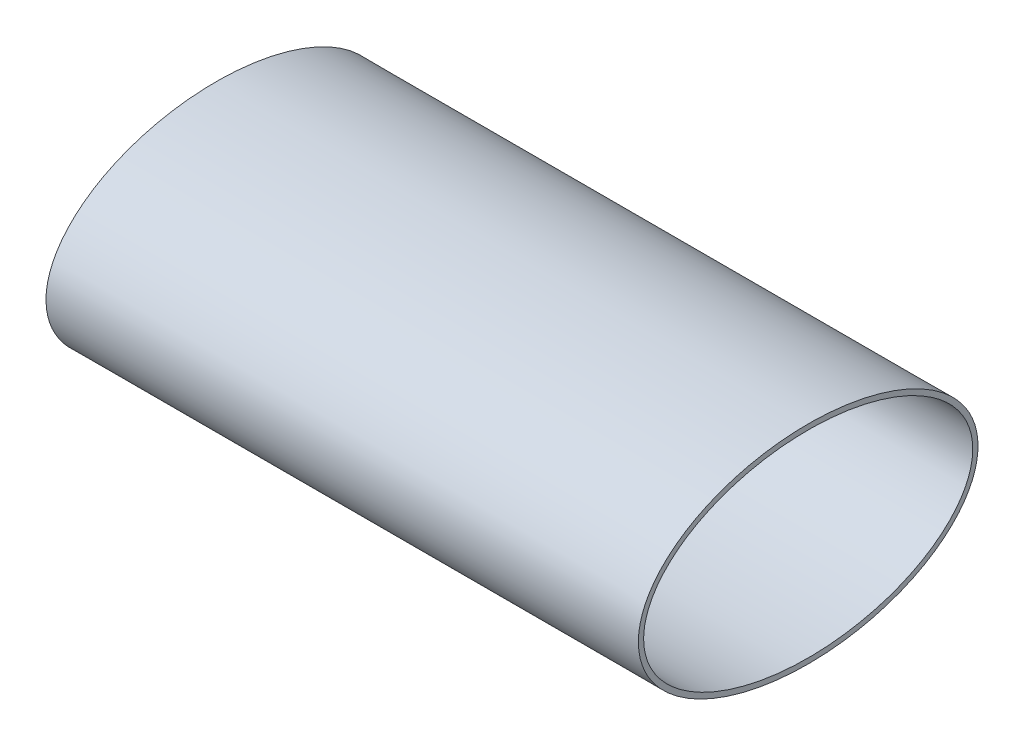
ISO-10303-21;
HEADER;
FILE_DESCRIPTION(('STEP AP214'),'2;1');
FILE_NAME('part.step','',(''),(''),'','','');
FILE_SCHEMA(('AUTOMOTIVE_DESIGN { 1 0 10303 214 1 1 1 1 }'));
ENDSEC;
DATA;
#1=APPLICATION_CONTEXT('core data for automotive mechanical design processes');
#2=APPLICATION_PROTOCOL_DEFINITION('international standard','automotive_design',2000,#1);
#3=PRODUCT_CONTEXT('',#1,'mechanical');
#4=PRODUCT('Part','Part','',(#3));
#5=PRODUCT_RELATED_PRODUCT_CATEGORY('part','',(#4));
#6=PRODUCT_DEFINITION_FORMATION('','',#4);
#7=PRODUCT_DEFINITION_CONTEXT('part definition',#1,'design');
#8=PRODUCT_DEFINITION('design','',#6,#7);
#9=PRODUCT_DEFINITION_SHAPE('','',#8);
#10=(LENGTH_UNIT() NAMED_UNIT(*) SI_UNIT(.MILLI.,.METRE.));
#11=(NAMED_UNIT(*) PLANE_ANGLE_UNIT() SI_UNIT($,.RADIAN.));
#12=(NAMED_UNIT(*) SI_UNIT($,.STERADIAN.) SOLID_ANGLE_UNIT());
#13=UNCERTAINTY_MEASURE_WITH_UNIT(LENGTH_MEASURE(1.E-05),#10,'distance_accuracy_value','');
#14=(GEOMETRIC_REPRESENTATION_CONTEXT(3) GLOBAL_UNCERTAINTY_ASSIGNED_CONTEXT((#13)) GLOBAL_UNIT_ASSIGNED_CONTEXT((#10,
#11,#12)) REPRESENTATION_CONTEXT('',''));
#15=CARTESIAN_POINT('',(0.,0.,0.));
#16=DIRECTION('',(0.,0.,1.));
#17=DIRECTION('',(1.,0.,0.));
#18=AXIS2_PLACEMENT_3D('',#15,#16,#17);
#19=CARTESIAN_POINT('',(225.,0.,-129.));
#20=DIRECTION('',(-1.,0.,0.));
#21=DIRECTION('',(0.,0.,1.));
#22=AXIS2_PLACEMENT_3D('',#19,#20,#21);
#23=PLANE('',#22);
#24=CARTESIAN_POINT('',(225.,0.,129.));
#25=CARTESIAN_POINT('',(225.,-5.34392674735436,129.));
#26=CARTESIAN_POINT('',(225.,-16.0317802420631,127.237324159451));
#27=CARTESIAN_POINT('',(225.,-36.2771593460236,116.973002762278));
#28=CARTESIAN_POINT('',(225.,-57.9529482344602,92.7070679149103));
#29=CARTESIAN_POINT('',(225.,-75.0240872448705,50.0235226287789));
#30=CARTESIAN_POINT('',(225.,-80.9879563775648,0.));
#31=CARTESIAN_POINT('',(225.,-75.0240872448705,-50.0235226287789));
#32=CARTESIAN_POINT('',(225.,-57.9529482344602,-92.7070679149103));
#33=CARTESIAN_POINT('',(225.,-36.2771593460236,-116.973002762278));
#34=CARTESIAN_POINT('',(225.,-16.0317802420631,-127.237324159451));
#35=CARTESIAN_POINT('',(225.,0.,-129.881337920274));
#36=CARTESIAN_POINT('',(225.,16.0317802420631,-127.237324159451));
#37=CARTESIAN_POINT('',(225.,36.2771593460236,-116.973002762278));
#38=CARTESIAN_POINT('',(225.,57.9529482344602,-92.7070679149104));
#39=CARTESIAN_POINT('',(225.,75.0240872448705,-50.0235226287789));
#40=CARTESIAN_POINT('',(225.,80.9879563775648,0.));
#41=CARTESIAN_POINT('',(225.,75.0240872448705,50.0235226287789));
#42=CARTESIAN_POINT('',(225.,57.9529482344602,92.7070679149103));
#43=CARTESIAN_POINT('',(225.,36.2771593460236,116.973002762278));
#44=CARTESIAN_POINT('',(225.,16.0317802420631,127.237324159451));
#45=CARTESIAN_POINT('',(225.,5.34392674735437,129.));
#46=CARTESIAN_POINT('',(225.,0.,129.));
#47=B_SPLINE_CURVE_WITH_KNOTS('',3,(#24,#25,#26,#27,#28,#29,#30,#31,#32,#33,#34,#35,#36,#37,#38,
#39,#40,#41,#42,#43,#44,#45,#46),.UNSPECIFIED.,.T.,.F.,(4,1,1,1,1,1,1,1,1,1,1,1,1,1,1,1,1,1,1,1,
4),(0.,0.196349540849362,0.392699081698724,0.785398163397448,1.17809724509617,1.5707963267949,
1.96349540849362,2.35619449019234,2.74889357189107,2.94524311274043,3.14159265358979,
3.33794219443916,3.53429173528852,3.92699081698724,4.31968989868597,4.71238898038469,
5.10508806208341,5.49778714378214,5.89048622548086,6.08683576633022,6.28318530717959),.UNSPECIFIED.);
#48=CARTESIAN_POINT('',(225.,0.,129.));
#49=VERTEX_POINT('',#48);
#50=EDGE_CURVE('E10',#49,#49,#47,.T.);
#51=ORIENTED_EDGE('',*,*,#50,.T.);
#52=EDGE_LOOP('',(#51));
#53=FACE_BOUND('',#52,.T.);
#54=CARTESIAN_POINT('',(225.,0.,0.));
#55=DIRECTION('',(1.,0.,0.));
#56=DIRECTION('',(0.,0.,1.));
#57=AXIS2_PLACEMENT_3D('',#54,#55,#56);
#58=ELLIPSE('',#57,125.,75.);
#59=CARTESIAN_POINT('',(225.,0.,125.));
#60=VERTEX_POINT('',#59);
#61=EDGE_CURVE('E44',#60,#60,#58,.T.);
#62=ORIENTED_EDGE('',*,*,#61,.F.);
#63=EDGE_LOOP('',(#62));
#64=FACE_BOUND('',#63,.T.);
#65=ADVANCED_FACE('F31',(#53,#64),#23,.F.);
#66=CARTESIAN_POINT('',(-225.,0.,-129.));
#67=DIRECTION('',(-1.,0.,0.));
#68=DIRECTION('',(0.,0.,1.));
#69=AXIS2_PLACEMENT_3D('',#66,#67,#68);
#70=PLANE('',#69);
#71=CARTESIAN_POINT('',(-225.,0.,129.));
#72=CARTESIAN_POINT('',(-225.,-5.34392674735436,129.));
#73=CARTESIAN_POINT('',(-225.,-16.0317802420631,127.237324159451));
#74=CARTESIAN_POINT('',(-225.,-36.2771593460236,116.973002762278));
#75=CARTESIAN_POINT('',(-225.,-57.9529482344602,92.7070679149103));
#76=CARTESIAN_POINT('',(-225.,-75.0240872448705,50.0235226287789));
#77=CARTESIAN_POINT('',(-225.,-80.9879563775648,0.));
#78=CARTESIAN_POINT('',(-225.,-75.0240872448705,-50.0235226287789));
#79=CARTESIAN_POINT('',(-225.,-57.9529482344602,-92.7070679149103));
#80=CARTESIAN_POINT('',(-225.,-36.2771593460236,-116.973002762278));
#81=CARTESIAN_POINT('',(-225.,-16.0317802420631,-127.237324159451));
#82=CARTESIAN_POINT('',(-225.,0.,-129.881337920274));
#83=CARTESIAN_POINT('',(-225.,16.0317802420631,-127.237324159451));
#84=CARTESIAN_POINT('',(-225.,36.2771593460236,-116.973002762278));
#85=CARTESIAN_POINT('',(-225.,57.9529482344602,-92.7070679149104));
#86=CARTESIAN_POINT('',(-225.,75.0240872448705,-50.0235226287789));
#87=CARTESIAN_POINT('',(-225.,80.9879563775648,0.));
#88=CARTESIAN_POINT('',(-225.,75.0240872448705,50.0235226287789));
#89=CARTESIAN_POINT('',(-225.,57.9529482344602,92.7070679149103));
#90=CARTESIAN_POINT('',(-225.,36.2771593460236,116.973002762278));
#91=CARTESIAN_POINT('',(-225.,16.0317802420631,127.237324159451));
#92=CARTESIAN_POINT('',(-225.,5.34392674735437,129.));
#93=CARTESIAN_POINT('',(-225.,0.,129.));
#94=B_SPLINE_CURVE_WITH_KNOTS('',3,(#71,#72,#73,#74,#75,#76,#77,#78,#79,#80,#81,#82,#83,#84,#85,
#86,#87,#88,#89,#90,#91,#92,#93),.UNSPECIFIED.,.T.,.F.,(4,1,1,1,1,1,1,1,1,1,1,1,1,1,1,1,1,1,1,1,
4),(0.,0.196349540849362,0.392699081698724,0.785398163397448,1.17809724509617,1.5707963267949,
1.96349540849362,2.35619449019234,2.74889357189107,2.94524311274043,3.14159265358979,
3.33794219443916,3.53429173528852,3.92699081698724,4.31968989868597,4.71238898038469,
5.10508806208341,5.49778714378214,5.89048622548086,6.08683576633022,6.28318530717959),.UNSPECIFIED.);
#95=CARTESIAN_POINT('',(-225.,0.,129.));
#96=VERTEX_POINT('',#95);
#97=EDGE_CURVE('E36',#96,#96,#94,.T.);
#98=ORIENTED_EDGE('',*,*,#97,.F.);
#99=EDGE_LOOP('',(#98));
#100=FACE_BOUND('',#99,.T.);
#101=CARTESIAN_POINT('',(-225.,0.,0.));
#102=DIRECTION('',(1.,0.,0.));
#103=DIRECTION('',(0.,0.,1.));
#104=AXIS2_PLACEMENT_3D('',#101,#102,#103);
#105=ELLIPSE('',#104,125.,75.);
#106=CARTESIAN_POINT('',(-225.,0.,125.));
#107=VERTEX_POINT('',#106);
#108=EDGE_CURVE('E49',#107,#107,#105,.T.);
#109=ORIENTED_EDGE('',*,*,#108,.T.);
#110=EDGE_LOOP('',(#109));
#111=FACE_BOUND('',#110,.T.);
#112=ADVANCED_FACE('F63',(#100,#111),#70,.T.);
#113=DIRECTION('',(-1.,0.,0.));
#114=VECTOR('',#113,1.);
#115=SURFACE_OF_LINEAR_EXTRUSION('',#47,#114);
#116=ORIENTED_EDGE('',*,*,#50,.F.);
#117=EDGE_LOOP('',(#116));
#118=FACE_BOUND('',#117,.T.);
#119=ORIENTED_EDGE('',*,*,#97,.T.);
#120=EDGE_LOOP('',(#119));
#121=FACE_BOUND('',#120,.T.);
#122=ADVANCED_FACE('F33',(#118,#121),#115,.F.);
#123=DIRECTION('',(-1.,0.,0.));
#124=VECTOR('',#123,1.);
#125=SURFACE_OF_LINEAR_EXTRUSION('',#58,#124);
#126=ORIENTED_EDGE('',*,*,#61,.T.);
#127=EDGE_LOOP('',(#126));
#128=FACE_BOUND('',#127,.T.);
#129=ORIENTED_EDGE('',*,*,#108,.F.);
#130=EDGE_LOOP('',(#129));
#131=FACE_BOUND('',#130,.T.);
#132=ADVANCED_FACE('F58',(#128,#131),#125,.T.);
#133=CLOSED_SHELL('',(#65,#112,#122,#132));
#134=MANIFOLD_SOLID_BREP('B2',#133);
#135=ADVANCED_BREP_SHAPE_REPRESENTATION('',(#18,#134),#14);
#136=SHAPE_DEFINITION_REPRESENTATION(#9,#135);
ENDSEC;
END-ISO-10303-21;
